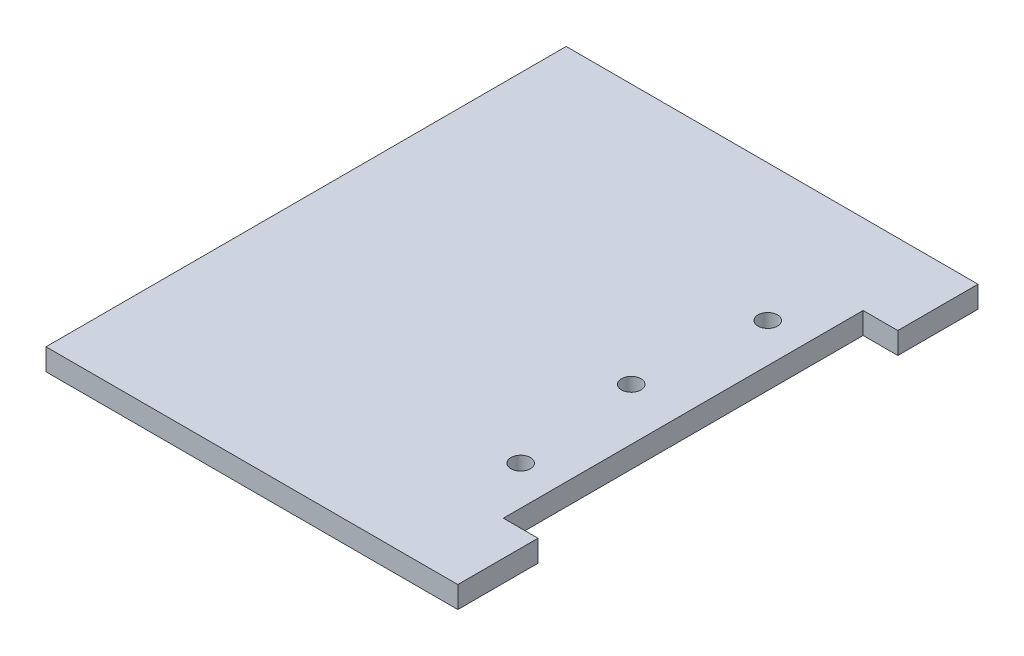
ISO-10303-21;
HEADER;
FILE_DESCRIPTION(('STEP AP214'),'2;1');
FILE_NAME('part.step','',(''),(''),'','','');
FILE_SCHEMA(('AUTOMOTIVE_DESIGN { 1 0 10303 214 1 1 1 1 }'));
ENDSEC;
DATA;
#1=APPLICATION_CONTEXT('core data for automotive mechanical design processes');
#2=APPLICATION_PROTOCOL_DEFINITION('international standard','automotive_design',2000,#1);
#3=PRODUCT_CONTEXT('',#1,'mechanical');
#4=PRODUCT('Part','Part','',(#3));
#5=PRODUCT_RELATED_PRODUCT_CATEGORY('part','',(#4));
#6=PRODUCT_DEFINITION_FORMATION('','',#4);
#7=PRODUCT_DEFINITION_CONTEXT('part definition',#1,'design');
#8=PRODUCT_DEFINITION('design','',#6,#7);
#9=PRODUCT_DEFINITION_SHAPE('','',#8);
#10=(LENGTH_UNIT() NAMED_UNIT(*) SI_UNIT(.MILLI.,.METRE.));
#11=(NAMED_UNIT(*) PLANE_ANGLE_UNIT() SI_UNIT($,.RADIAN.));
#12=(NAMED_UNIT(*) SI_UNIT($,.STERADIAN.) SOLID_ANGLE_UNIT());
#13=UNCERTAINTY_MEASURE_WITH_UNIT(LENGTH_MEASURE(1.E-05),#10,'distance_accuracy_value','');
#14=(GEOMETRIC_REPRESENTATION_CONTEXT(3) GLOBAL_UNCERTAINTY_ASSIGNED_CONTEXT((#13)) GLOBAL_UNIT_ASSIGNED_CONTEXT((#10,
#11,#12)) REPRESENTATION_CONTEXT('',''));
#15=CARTESIAN_POINT('',(0.,0.,0.));
#16=DIRECTION('',(0.,0.,1.));
#17=DIRECTION('',(1.,0.,0.));
#18=AXIS2_PLACEMENT_3D('',#15,#16,#17);
#19=CARTESIAN_POINT('',(47.5,5.,60.));
#20=DIRECTION('',(-1.,0.,0.));
#21=DIRECTION('',(0.,0.,1.));
#22=AXIS2_PLACEMENT_3D('',#19,#20,#21);
#23=PLANE('',#22);
#24=DIRECTION('',(0.,0.,-1.));
#25=VECTOR('',#24,1.);
#26=CARTESIAN_POINT('',(47.5,0.,60.));
#27=LINE('',#26,#25);
#28=CARTESIAN_POINT('',(47.5,0.,60.));
#29=VERTEX_POINT('',#28);
#30=CARTESIAN_POINT('',(47.5,0.,41.5));
#31=VERTEX_POINT('',#30);
#32=EDGE_CURVE('E142',#29,#31,#27,.T.);
#33=ORIENTED_EDGE('',*,*,#32,.T.);
#34=DIRECTION('',(0.,-1.,0.));
#35=VECTOR('',#34,1.);
#36=CARTESIAN_POINT('',(47.5,5.,41.5));
#37=LINE('',#36,#35);
#38=CARTESIAN_POINT('',(47.5,5.,41.5));
#39=VERTEX_POINT('',#38);
#40=EDGE_CURVE('E164',#39,#31,#37,.T.);
#41=ORIENTED_EDGE('',*,*,#40,.F.);
#42=DIRECTION('',(0.,0.,-1.));
#43=VECTOR('',#42,1.);
#44=CARTESIAN_POINT('',(47.5,5.,60.));
#45=LINE('',#44,#43);
#46=CARTESIAN_POINT('',(47.5,5.,60.));
#47=VERTEX_POINT('',#46);
#48=EDGE_CURVE('E134',#47,#39,#45,.T.);
#49=ORIENTED_EDGE('',*,*,#48,.F.);
#50=DIRECTION('',(0.,-1.,0.));
#51=VECTOR('',#50,1.);
#52=CARTESIAN_POINT('',(47.5,5.,60.));
#53=LINE('',#52,#51);
#54=EDGE_CURVE('E141',#47,#29,#53,.T.);
#55=ORIENTED_EDGE('',*,*,#54,.T.);
#56=EDGE_LOOP('',(#33,#41,#49,#55));
#57=FACE_BOUND('',#56,.T.);
#58=ADVANCED_FACE('F33',(#57),#23,.F.);
#59=CARTESIAN_POINT('',(47.5,5.,-41.5));
#60=VERTEX_POINT('',#59);
#61=CARTESIAN_POINT('',(47.5,5.,-60.));
#62=VERTEX_POINT('',#61);
#63=EDGE_CURVE('E85',#60,#62,#45,.T.);
#64=ORIENTED_EDGE('',*,*,#63,.F.);
#65=DIRECTION('',(0.,1.,0.));
#66=VECTOR('',#65,1.);
#67=CARTESIAN_POINT('',(47.5,5.,-41.5));
#68=LINE('',#67,#66);
#69=CARTESIAN_POINT('',(47.5,0.,-41.5));
#70=VERTEX_POINT('',#69);
#71=EDGE_CURVE('E189',#70,#60,#68,.T.);
#72=ORIENTED_EDGE('',*,*,#71,.F.);
#73=CARTESIAN_POINT('',(47.5,0.,-60.));
#74=VERTEX_POINT('',#73);
#75=EDGE_CURVE('E126',#70,#74,#27,.T.);
#76=ORIENTED_EDGE('',*,*,#75,.T.);
#77=DIRECTION('',(0.,-1.,0.));
#78=VECTOR('',#77,1.);
#79=CARTESIAN_POINT('',(47.5,5.,-60.));
#80=LINE('',#79,#78);
#81=EDGE_CURVE('E11',#62,#74,#80,.T.);
#82=ORIENTED_EDGE('',*,*,#81,.F.);
#83=EDGE_LOOP('',(#64,#72,#76,#82));
#84=FACE_BOUND('',#83,.T.);
#85=ADVANCED_FACE('F35',(#84),#23,.F.);
#86=CARTESIAN_POINT('',(-47.5,5.,-60.));
#87=DIRECTION('',(0.,0.,1.));
#88=DIRECTION('',(1.,0.,0.));
#89=AXIS2_PLACEMENT_3D('',#86,#87,#88);
#90=PLANE('',#89);
#91=DIRECTION('',(-1.,0.,0.));
#92=VECTOR('',#91,1.);
#93=CARTESIAN_POINT('',(-47.5,0.,-60.));
#94=LINE('',#93,#92);
#95=CARTESIAN_POINT('',(-47.5,0.,-60.));
#96=VERTEX_POINT('',#95);
#97=EDGE_CURVE('E145',#74,#96,#94,.T.);
#98=ORIENTED_EDGE('',*,*,#97,.T.);
#99=DIRECTION('',(0.,-1.,0.));
#100=VECTOR('',#99,1.);
#101=CARTESIAN_POINT('',(-47.5,5.,-60.));
#102=LINE('',#101,#100);
#103=CARTESIAN_POINT('',(-47.5,5.,-60.));
#104=VERTEX_POINT('',#103);
#105=EDGE_CURVE('E41',#104,#96,#102,.T.);
#106=ORIENTED_EDGE('',*,*,#105,.F.);
#107=DIRECTION('',(-1.,0.,0.));
#108=VECTOR('',#107,1.);
#109=CARTESIAN_POINT('',(-47.5,5.,-60.));
#110=LINE('',#109,#108);
#111=EDGE_CURVE('E136',#62,#104,#110,.T.);
#112=ORIENTED_EDGE('',*,*,#111,.F.);
#113=ORIENTED_EDGE('',*,*,#81,.T.);
#114=EDGE_LOOP('',(#98,#106,#112,#113));
#115=FACE_BOUND('',#114,.T.);
#116=ADVANCED_FACE('F176',(#115),#90,.F.);
#117=CARTESIAN_POINT('',(-47.5,5.,60.));
#118=DIRECTION('',(1.,0.,0.));
#119=DIRECTION('',(0.,0.,-1.));
#120=AXIS2_PLACEMENT_3D('',#117,#118,#119);
#121=PLANE('',#120);
#122=DIRECTION('',(0.,0.,1.));
#123=VECTOR('',#122,1.);
#124=CARTESIAN_POINT('',(-47.5,0.,60.));
#125=LINE('',#124,#123);
#126=CARTESIAN_POINT('',(-47.5,0.,60.));
#127=VERTEX_POINT('',#126);
#128=EDGE_CURVE('E147',#96,#127,#125,.T.);
#129=ORIENTED_EDGE('',*,*,#128,.T.);
#130=DIRECTION('',(0.,-1.,0.));
#131=VECTOR('',#130,1.);
#132=CARTESIAN_POINT('',(-47.5,5.,60.));
#133=LINE('',#132,#131);
#134=CARTESIAN_POINT('',(-47.5,5.,60.));
#135=VERTEX_POINT('',#134);
#136=EDGE_CURVE('E151',#135,#127,#133,.T.);
#137=ORIENTED_EDGE('',*,*,#136,.F.);
#138=DIRECTION('',(0.,0.,1.));
#139=VECTOR('',#138,1.);
#140=CARTESIAN_POINT('',(-47.5,5.,60.));
#141=LINE('',#140,#139);
#142=EDGE_CURVE('E138',#104,#135,#141,.T.);
#143=ORIENTED_EDGE('',*,*,#142,.F.);
#144=ORIENTED_EDGE('',*,*,#105,.T.);
#145=EDGE_LOOP('',(#129,#137,#143,#144));
#146=FACE_BOUND('',#145,.T.);
#147=ADVANCED_FACE('F157',(#146),#121,.F.);
#148=CARTESIAN_POINT('',(-47.5,5.,60.));
#149=DIRECTION('',(0.,0.,-1.));
#150=DIRECTION('',(-1.,0.,0.));
#151=AXIS2_PLACEMENT_3D('',#148,#149,#150);
#152=PLANE('',#151);
#153=DIRECTION('',(1.,0.,0.));
#154=VECTOR('',#153,1.);
#155=CARTESIAN_POINT('',(-47.5,0.,60.));
#156=LINE('',#155,#154);
#157=EDGE_CURVE('E78',#127,#29,#156,.T.);
#158=ORIENTED_EDGE('',*,*,#157,.T.);
#159=ORIENTED_EDGE('',*,*,#54,.F.);
#160=DIRECTION('',(1.,0.,0.));
#161=VECTOR('',#160,1.);
#162=CARTESIAN_POINT('',(-47.5,5.,60.));
#163=LINE('',#162,#161);
#164=EDGE_CURVE('E57',#135,#47,#163,.T.);
#165=ORIENTED_EDGE('',*,*,#164,.F.);
#166=ORIENTED_EDGE('',*,*,#136,.T.);
#167=EDGE_LOOP('',(#158,#159,#165,#166));
#168=FACE_BOUND('',#167,.T.);
#169=ADVANCED_FACE('F165',(#168),#152,.F.);
#170=CARTESIAN_POINT('',(0.,5.,0.));
#171=DIRECTION('',(0.,-1.,0.));
#172=DIRECTION('',(0.,0.,-1.));
#173=AXIS2_PLACEMENT_3D('',#170,#171,#172);
#174=PLANE('',#173);
#175=CARTESIAN_POINT('',(30.5,5.,-28.5));
#176=DIRECTION('',(0.,1.,0.));
#177=DIRECTION('',(0.,0.,1.));
#178=AXIS2_PLACEMENT_3D('',#175,#176,#177);
#179=CIRCLE('',#178,2.24999999999999);
#180=CARTESIAN_POINT('',(30.5,5.,-26.25));
#181=VERTEX_POINT('',#180);
#182=EDGE_CURVE('E212',#181,#181,#179,.T.);
#183=ORIENTED_EDGE('',*,*,#182,.F.);
#184=EDGE_LOOP('',(#183));
#185=FACE_BOUND('',#184,.T.);
#186=CARTESIAN_POINT('',(27.5,5.,0.));
#187=DIRECTION('',(0.,1.,0.));
#188=DIRECTION('',(0.,0.,1.));
#189=AXIS2_PLACEMENT_3D('',#186,#187,#188);
#190=CIRCLE('',#189,2.24999999999999);
#191=CARTESIAN_POINT('',(27.5,5.,2.24999999999999));
#192=VERTEX_POINT('',#191);
#193=EDGE_CURVE('E206',#192,#192,#190,.T.);
#194=ORIENTED_EDGE('',*,*,#193,.F.);
#195=EDGE_LOOP('',(#194));
#196=FACE_BOUND('',#195,.T.);
#197=CARTESIAN_POINT('',(30.5,5.,28.5));
#198=DIRECTION('',(0.,1.,0.));
#199=DIRECTION('',(0.,0.,1.));
#200=AXIS2_PLACEMENT_3D('',#197,#198,#199);
#201=CIRCLE('',#200,2.24999999999999);
#202=CARTESIAN_POINT('',(30.5,5.,30.75));
#203=VERTEX_POINT('',#202);
#204=EDGE_CURVE('E200',#203,#203,#201,.T.);
#205=ORIENTED_EDGE('',*,*,#204,.F.);
#206=EDGE_LOOP('',(#205));
#207=FACE_BOUND('',#206,.T.);
#208=ORIENTED_EDGE('',*,*,#48,.T.);
#209=DIRECTION('',(1.,0.,0.));
#210=VECTOR('',#209,1.);
#211=CARTESIAN_POINT('',(39.5,5.,41.5));
#212=LINE('',#211,#210);
#213=CARTESIAN_POINT('',(39.5,5.,41.5));
#214=VERTEX_POINT('',#213);
#215=EDGE_CURVE('E129',#214,#39,#212,.T.);
#216=ORIENTED_EDGE('',*,*,#215,.F.);
#217=DIRECTION('',(0.,0.,1.));
#218=VECTOR('',#217,1.);
#219=CARTESIAN_POINT('',(39.5,5.,41.5));
#220=LINE('',#219,#218);
#221=CARTESIAN_POINT('',(39.5,5.,-41.5));
#222=VERTEX_POINT('',#221);
#223=EDGE_CURVE('E115',#222,#214,#220,.T.);
#224=ORIENTED_EDGE('',*,*,#223,.F.);
#225=DIRECTION('',(1.,0.,0.));
#226=VECTOR('',#225,1.);
#227=CARTESIAN_POINT('',(39.5,5.,-41.5));
#228=LINE('',#227,#226);
#229=EDGE_CURVE('E113',#222,#60,#228,.T.);
#230=ORIENTED_EDGE('',*,*,#229,.T.);
#231=ORIENTED_EDGE('',*,*,#63,.T.);
#232=ORIENTED_EDGE('',*,*,#111,.T.);
#233=ORIENTED_EDGE('',*,*,#142,.T.);
#234=ORIENTED_EDGE('',*,*,#164,.T.);
#235=EDGE_LOOP('',(#208,#216,#224,#230,#231,#232,#233,#234));
#236=FACE_BOUND('',#235,.T.);
#237=ADVANCED_FACE('F167',(#185,#196,#207,#236),#174,.F.);
#238=CARTESIAN_POINT('',(0.,0.,0.));
#239=DIRECTION('',(0.,-1.,0.));
#240=DIRECTION('',(0.,0.,-1.));
#241=AXIS2_PLACEMENT_3D('',#238,#239,#240);
#242=PLANE('',#241);
#243=CARTESIAN_POINT('',(30.5,0.,-28.5));
#244=DIRECTION('',(0.,1.,0.));
#245=DIRECTION('',(0.,0.,1.));
#246=AXIS2_PLACEMENT_3D('',#243,#244,#245);
#247=CIRCLE('',#246,2.25);
#248=CARTESIAN_POINT('',(30.5,0.,-26.25));
#249=VERTEX_POINT('',#248);
#250=EDGE_CURVE('E209',#249,#249,#247,.T.);
#251=ORIENTED_EDGE('',*,*,#250,.T.);
#252=EDGE_LOOP('',(#251));
#253=FACE_BOUND('',#252,.T.);
#254=CARTESIAN_POINT('',(27.5,0.,0.));
#255=DIRECTION('',(0.,1.,0.));
#256=DIRECTION('',(0.,0.,1.));
#257=AXIS2_PLACEMENT_3D('',#254,#255,#256);
#258=CIRCLE('',#257,2.25);
#259=CARTESIAN_POINT('',(27.5,0.,2.25));
#260=VERTEX_POINT('',#259);
#261=EDGE_CURVE('E203',#260,#260,#258,.T.);
#262=ORIENTED_EDGE('',*,*,#261,.T.);
#263=EDGE_LOOP('',(#262));
#264=FACE_BOUND('',#263,.T.);
#265=CARTESIAN_POINT('',(30.5,0.,28.5));
#266=DIRECTION('',(0.,1.,0.));
#267=DIRECTION('',(0.,0.,1.));
#268=AXIS2_PLACEMENT_3D('',#265,#266,#267);
#269=CIRCLE('',#268,2.25);
#270=CARTESIAN_POINT('',(30.5,0.,30.75));
#271=VERTEX_POINT('',#270);
#272=EDGE_CURVE('E195',#271,#271,#269,.T.);
#273=ORIENTED_EDGE('',*,*,#272,.T.);
#274=EDGE_LOOP('',(#273));
#275=FACE_BOUND('',#274,.T.);
#276=DIRECTION('',(1.,0.,0.));
#277=VECTOR('',#276,1.);
#278=CARTESIAN_POINT('',(39.5,0.,41.5));
#279=LINE('',#278,#277);
#280=CARTESIAN_POINT('',(39.5,0.,41.5));
#281=VERTEX_POINT('',#280);
#282=EDGE_CURVE('E127',#281,#31,#279,.T.);
#283=ORIENTED_EDGE('',*,*,#282,.T.);
#284=ORIENTED_EDGE('',*,*,#32,.F.);
#285=ORIENTED_EDGE('',*,*,#157,.F.);
#286=ORIENTED_EDGE('',*,*,#128,.F.);
#287=ORIENTED_EDGE('',*,*,#97,.F.);
#288=ORIENTED_EDGE('',*,*,#75,.F.);
#289=DIRECTION('',(1.,0.,0.));
#290=VECTOR('',#289,1.);
#291=CARTESIAN_POINT('',(39.5,0.,-41.5));
#292=LINE('',#291,#290);
#293=CARTESIAN_POINT('',(39.5,0.,-41.5));
#294=VERTEX_POINT('',#293);
#295=EDGE_CURVE('E111',#294,#70,#292,.T.);
#296=ORIENTED_EDGE('',*,*,#295,.F.);
#297=DIRECTION('',(0.,0.,-1.));
#298=VECTOR('',#297,1.);
#299=CARTESIAN_POINT('',(39.5,0.,41.5));
#300=LINE('',#299,#298);
#301=EDGE_CURVE('E116',#281,#294,#300,.T.);
#302=ORIENTED_EDGE('',*,*,#301,.F.);
#303=EDGE_LOOP('',(#283,#284,#285,#286,#287,#288,#296,#302));
#304=FACE_BOUND('',#303,.T.);
#305=ADVANCED_FACE('F124',(#253,#264,#275,#304),#242,.T.);
#306=CARTESIAN_POINT('',(39.5,5.,41.5));
#307=DIRECTION('',(0.,0.,1.));
#308=DIRECTION('',(1.,0.,0.));
#309=AXIS2_PLACEMENT_3D('',#306,#307,#308);
#310=PLANE('',#309);
#311=ORIENTED_EDGE('',*,*,#40,.T.);
#312=ORIENTED_EDGE('',*,*,#282,.F.);
#313=DIRECTION('',(0.,-1.,0.));
#314=VECTOR('',#313,1.);
#315=CARTESIAN_POINT('',(39.5,5.,41.5));
#316=LINE('',#315,#314);
#317=EDGE_CURVE('E48',#214,#281,#316,.T.);
#318=ORIENTED_EDGE('',*,*,#317,.F.);
#319=ORIENTED_EDGE('',*,*,#215,.T.);
#320=EDGE_LOOP('',(#311,#312,#318,#319));
#321=FACE_BOUND('',#320,.T.);
#322=ADVANCED_FACE('F239',(#321),#310,.F.);
#323=CARTESIAN_POINT('',(39.5,5.,-41.5));
#324=DIRECTION('',(0.,0.,-1.));
#325=DIRECTION('',(0.,1.,0.));
#326=AXIS2_PLACEMENT_3D('',#323,#324,#325);
#327=PLANE('',#326);
#328=ORIENTED_EDGE('',*,*,#71,.T.);
#329=ORIENTED_EDGE('',*,*,#229,.F.);
#330=DIRECTION('',(0.,1.,0.));
#331=VECTOR('',#330,1.);
#332=CARTESIAN_POINT('',(39.5,5.,-41.5));
#333=LINE('',#332,#331);
#334=EDGE_CURVE('E108',#294,#222,#333,.T.);
#335=ORIENTED_EDGE('',*,*,#334,.F.);
#336=ORIENTED_EDGE('',*,*,#295,.T.);
#337=EDGE_LOOP('',(#328,#329,#335,#336));
#338=FACE_BOUND('',#337,.T.);
#339=ADVANCED_FACE('F109',(#338),#327,.F.);
#340=CARTESIAN_POINT('',(39.5,0.,0.));
#341=DIRECTION('',(1.,0.,0.));
#342=DIRECTION('',(0.,0.,-1.));
#343=AXIS2_PLACEMENT_3D('',#340,#341,#342);
#344=PLANE('',#343);
#345=ORIENTED_EDGE('',*,*,#317,.T.);
#346=ORIENTED_EDGE('',*,*,#301,.T.);
#347=ORIENTED_EDGE('',*,*,#334,.T.);
#348=ORIENTED_EDGE('',*,*,#223,.T.);
#349=EDGE_LOOP('',(#345,#346,#347,#348));
#350=FACE_BOUND('',#349,.T.);
#351=ADVANCED_FACE('F119',(#350),#344,.T.);
#352=CARTESIAN_POINT('',(30.5,5.,28.5));
#353=DIRECTION('',(0.,1.,0.));
#354=DIRECTION('',(0.,0.,1.));
#355=AXIS2_PLACEMENT_3D('',#352,#353,#354);
#356=CYLINDRICAL_SURFACE('',#355,2.24999999999999);
#357=ORIENTED_EDGE('',*,*,#272,.F.);
#358=EDGE_LOOP('',(#357));
#359=FACE_BOUND('',#358,.T.);
#360=ORIENTED_EDGE('',*,*,#204,.T.);
#361=EDGE_LOOP('',(#360));
#362=FACE_BOUND('',#361,.T.);
#363=ADVANCED_FACE('F222',(#359,#362),#356,.F.);
#364=CARTESIAN_POINT('',(27.5,5.,0.));
#365=DIRECTION('',(0.,1.,0.));
#366=DIRECTION('',(0.,0.,1.));
#367=AXIS2_PLACEMENT_3D('',#364,#365,#366);
#368=CYLINDRICAL_SURFACE('',#367,2.24999999999999);
#369=ORIENTED_EDGE('',*,*,#261,.F.);
#370=EDGE_LOOP('',(#369));
#371=FACE_BOUND('',#370,.T.);
#372=ORIENTED_EDGE('',*,*,#193,.T.);
#373=EDGE_LOOP('',(#372));
#374=FACE_BOUND('',#373,.T.);
#375=ADVANCED_FACE('F224',(#371,#374),#368,.F.);
#376=CARTESIAN_POINT('',(30.5,5.,-28.5));
#377=DIRECTION('',(0.,1.,0.));
#378=DIRECTION('',(0.,0.,1.));
#379=AXIS2_PLACEMENT_3D('',#376,#377,#378);
#380=CYLINDRICAL_SURFACE('',#379,2.24999999999999);
#381=ORIENTED_EDGE('',*,*,#250,.F.);
#382=EDGE_LOOP('',(#381));
#383=FACE_BOUND('',#382,.T.);
#384=ORIENTED_EDGE('',*,*,#182,.T.);
#385=EDGE_LOOP('',(#384));
#386=FACE_BOUND('',#385,.T.);
#387=ADVANCED_FACE('F216',(#383,#386),#380,.F.);
#388=CLOSED_SHELL('',(#58,#85,#116,#147,#169,#237,#305,#322,#339,#351,#363,#375,#387));
#389=MANIFOLD_SOLID_BREP('B2',#388);
#390=ADVANCED_BREP_SHAPE_REPRESENTATION('',(#18,#389),#14);
#391=SHAPE_DEFINITION_REPRESENTATION(#9,#390);
ENDSEC;
END-ISO-10303-21;
